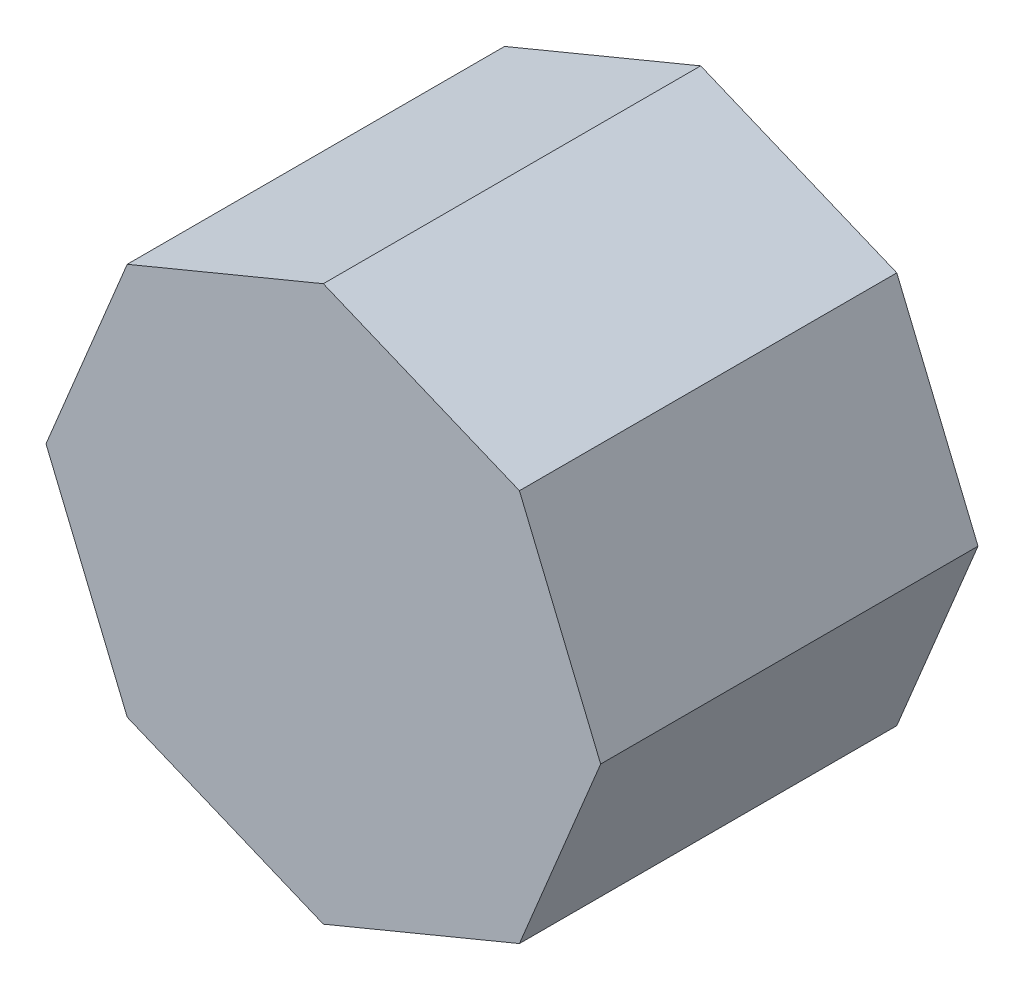
ISO-10303-21;
HEADER;
FILE_DESCRIPTION(('STEP AP214'),'2;1');
FILE_NAME('part.step','',(''),(''),'','','');
FILE_SCHEMA(('AUTOMOTIVE_DESIGN { 1 0 10303 214 1 1 1 1 }'));
ENDSEC;
DATA;
#1=APPLICATION_CONTEXT('core data for automotive mechanical design processes');
#2=APPLICATION_PROTOCOL_DEFINITION('international standard','automotive_design',2000,#1);
#3=PRODUCT_CONTEXT('',#1,'mechanical');
#4=PRODUCT('Part','Part','',(#3));
#5=PRODUCT_RELATED_PRODUCT_CATEGORY('part','',(#4));
#6=PRODUCT_DEFINITION_FORMATION('','',#4);
#7=PRODUCT_DEFINITION_CONTEXT('part definition',#1,'design');
#8=PRODUCT_DEFINITION('design','',#6,#7);
#9=PRODUCT_DEFINITION_SHAPE('','',#8);
#10=(LENGTH_UNIT() NAMED_UNIT(*) SI_UNIT(.MILLI.,.METRE.));
#11=(NAMED_UNIT(*) PLANE_ANGLE_UNIT() SI_UNIT($,.RADIAN.));
#12=(NAMED_UNIT(*) SI_UNIT($,.STERADIAN.) SOLID_ANGLE_UNIT());
#13=UNCERTAINTY_MEASURE_WITH_UNIT(LENGTH_MEASURE(1.E-05),#10,'distance_accuracy_value','');
#14=(GEOMETRIC_REPRESENTATION_CONTEXT(3) GLOBAL_UNCERTAINTY_ASSIGNED_CONTEXT((#13)) GLOBAL_UNIT_ASSIGNED_CONTEXT((#10,
#11,#12)) REPRESENTATION_CONTEXT('',''));
#15=CARTESIAN_POINT('',(0.,0.,0.));
#16=DIRECTION('',(0.,0.,1.));
#17=DIRECTION('',(1.,0.,0.));
#18=AXIS2_PLACEMENT_3D('',#15,#16,#17);
#19=CARTESIAN_POINT('',(-0.1530731,0.,0.20828));
#20=DIRECTION('',(0.,0.,-1.));
#21=DIRECTION('',(0.,-1.,0.));
#22=AXIS2_PLACEMENT_3D('',#19,#20,#21);
#23=PLANE('',#22);
#24=DIRECTION('',(0.382677940983037,-0.923881807097089,0.));
#25=VECTOR('',#24,1.);
#26=CARTESIAN_POINT('',(-0.1530731,0.,0.20828));
#27=LINE('',#26,#25);
#28=CARTESIAN_POINT('',(-0.1530731,0.,0.20828));
#29=VERTEX_POINT('',#28);
#30=CARTESIAN_POINT('',(-0.10823956,-0.10823956,0.20828));
#31=VERTEX_POINT('',#30);
#32=EDGE_CURVE('E164',#29,#31,#27,.T.);
#33=ORIENTED_EDGE('',*,*,#32,.T.);
#34=DIRECTION('',(0.923881807097089,-0.382677940983037,0.));
#35=VECTOR('',#34,1.);
#36=CARTESIAN_POINT('',(-0.10823956,-0.10823956,0.20828));
#37=LINE('',#36,#35);
#38=CARTESIAN_POINT('',(0.,-0.1530731,0.20828));
#39=VERTEX_POINT('',#38);
#40=EDGE_CURVE('E102',#31,#39,#37,.T.);
#41=ORIENTED_EDGE('',*,*,#40,.T.);
#42=DIRECTION('',(0.923881807097089,0.382677940983037,0.));
#43=VECTOR('',#42,1.);
#44=CARTESIAN_POINT('',(0.,-0.1530731,0.20828));
#45=LINE('',#44,#43);
#46=CARTESIAN_POINT('',(0.10823956,-0.10823956,0.20828));
#47=VERTEX_POINT('',#46);
#48=EDGE_CURVE('E100',#39,#47,#45,.T.);
#49=ORIENTED_EDGE('',*,*,#48,.T.);
#50=DIRECTION('',(0.382677940983037,0.923881807097089,0.));
#51=VECTOR('',#50,1.);
#52=CARTESIAN_POINT('',(0.10823956,-0.10823956,0.20828));
#53=LINE('',#52,#51);
#54=CARTESIAN_POINT('',(0.1530731,0.,0.20828));
#55=VERTEX_POINT('',#54);
#56=EDGE_CURVE('E84',#47,#55,#53,.T.);
#57=ORIENTED_EDGE('',*,*,#56,.T.);
#58=DIRECTION('',(-0.382677940983037,0.923881807097089,0.));
#59=VECTOR('',#58,1.);
#60=CARTESIAN_POINT('',(0.1530731,0.,0.20828));
#61=LINE('',#60,#59);
#62=CARTESIAN_POINT('',(0.10823956,0.10823956,0.20828));
#63=VERTEX_POINT('',#62);
#64=EDGE_CURVE('E146',#55,#63,#61,.T.);
#65=ORIENTED_EDGE('',*,*,#64,.T.);
#66=DIRECTION('',(-0.923881807097089,0.382677940983037,0.));
#67=VECTOR('',#66,1.);
#68=CARTESIAN_POINT('',(0.10823956,0.10823956,0.20828));
#69=LINE('',#68,#67);
#70=CARTESIAN_POINT('',(0.,0.1530731,0.20828));
#71=VERTEX_POINT('',#70);
#72=EDGE_CURVE('E141',#63,#71,#69,.T.);
#73=ORIENTED_EDGE('',*,*,#72,.T.);
#74=DIRECTION('',(-0.923881807097089,-0.382677940983037,0.));
#75=VECTOR('',#74,1.);
#76=CARTESIAN_POINT('',(0.,0.1530731,0.20828));
#77=LINE('',#76,#75);
#78=CARTESIAN_POINT('',(-0.10823956,0.10823956,0.20828));
#79=VERTEX_POINT('',#78);
#80=EDGE_CURVE('E123',#71,#79,#77,.T.);
#81=ORIENTED_EDGE('',*,*,#80,.T.);
#82=DIRECTION('',(-0.382677940983037,-0.923881807097089,0.));
#83=VECTOR('',#82,1.);
#84=CARTESIAN_POINT('',(-0.10823956,0.10823956,0.20828));
#85=LINE('',#84,#83);
#86=EDGE_CURVE('E11',#79,#29,#85,.T.);
#87=ORIENTED_EDGE('',*,*,#86,.T.);
#88=EDGE_LOOP('',(#33,#41,#49,#57,#65,#73,#81,#87));
#89=FACE_BOUND('',#88,.T.);
#90=ADVANCED_FACE('F17',(#89),#23,.F.);
#91=CARTESIAN_POINT('',(-0.1530731,0.,0.));
#92=DIRECTION('',(0.,0.,-1.));
#93=DIRECTION('',(0.,-1.,0.));
#94=AXIS2_PLACEMENT_3D('',#91,#92,#93);
#95=PLANE('',#94);
#96=DIRECTION('',(-0.382677940983037,-0.923881807097089,0.));
#97=VECTOR('',#96,1.);
#98=CARTESIAN_POINT('',(-0.10823956,0.10823956,0.));
#99=LINE('',#98,#97);
#100=CARTESIAN_POINT('',(-0.10823956,0.10823956,0.));
#101=VERTEX_POINT('',#100);
#102=CARTESIAN_POINT('',(-0.1530731,0.,0.));
#103=VERTEX_POINT('',#102);
#104=EDGE_CURVE('E28',#101,#103,#99,.T.);
#105=ORIENTED_EDGE('',*,*,#104,.F.);
#106=DIRECTION('',(-0.923881807097089,-0.382677940983037,0.));
#107=VECTOR('',#106,1.);
#108=CARTESIAN_POINT('',(0.,0.1530731,0.));
#109=LINE('',#108,#107);
#110=CARTESIAN_POINT('',(0.,0.1530731,0.));
#111=VERTEX_POINT('',#110);
#112=EDGE_CURVE('E117',#111,#101,#109,.T.);
#113=ORIENTED_EDGE('',*,*,#112,.F.);
#114=DIRECTION('',(-0.923881807097089,0.382677940983037,0.));
#115=VECTOR('',#114,1.);
#116=CARTESIAN_POINT('',(0.10823956,0.10823956,0.));
#117=LINE('',#116,#115);
#118=CARTESIAN_POINT('',(0.10823956,0.10823956,0.));
#119=VERTEX_POINT('',#118);
#120=EDGE_CURVE('E149',#119,#111,#117,.T.);
#121=ORIENTED_EDGE('',*,*,#120,.F.);
#122=DIRECTION('',(-0.382677940983037,0.923881807097089,0.));
#123=VECTOR('',#122,1.);
#124=CARTESIAN_POINT('',(0.1530731,0.,0.));
#125=LINE('',#124,#123);
#126=CARTESIAN_POINT('',(0.1530731,0.,0.));
#127=VERTEX_POINT('',#126);
#128=EDGE_CURVE('E96',#127,#119,#125,.T.);
#129=ORIENTED_EDGE('',*,*,#128,.F.);
#130=DIRECTION('',(0.382677940983037,0.923881807097089,0.));
#131=VECTOR('',#130,1.);
#132=CARTESIAN_POINT('',(0.10823956,-0.10823956,0.));
#133=LINE('',#132,#131);
#134=CARTESIAN_POINT('',(0.10823956,-0.10823956,0.));
#135=VERTEX_POINT('',#134);
#136=EDGE_CURVE('E107',#135,#127,#133,.T.);
#137=ORIENTED_EDGE('',*,*,#136,.F.);
#138=DIRECTION('',(0.923881807097089,0.382677940983037,0.));
#139=VECTOR('',#138,1.);
#140=CARTESIAN_POINT('',(0.,-0.1530731,0.));
#141=LINE('',#140,#139);
#142=CARTESIAN_POINT('',(0.,-0.1530731,0.));
#143=VERTEX_POINT('',#142);
#144=EDGE_CURVE('E21',#143,#135,#141,.T.);
#145=ORIENTED_EDGE('',*,*,#144,.F.);
#146=DIRECTION('',(0.923881807097089,-0.382677940983037,0.));
#147=VECTOR('',#146,1.);
#148=CARTESIAN_POINT('',(-0.10823956,-0.10823956,0.));
#149=LINE('',#148,#147);
#150=CARTESIAN_POINT('',(-0.10823956,-0.10823956,0.));
#151=VERTEX_POINT('',#150);
#152=EDGE_CURVE('E131',#151,#143,#149,.T.);
#153=ORIENTED_EDGE('',*,*,#152,.F.);
#154=DIRECTION('',(0.382677940983037,-0.923881807097089,0.));
#155=VECTOR('',#154,1.);
#156=CARTESIAN_POINT('',(-0.1530731,0.,0.));
#157=LINE('',#156,#155);
#158=EDGE_CURVE('E126',#103,#151,#157,.T.);
#159=ORIENTED_EDGE('',*,*,#158,.F.);
#160=EDGE_LOOP('',(#105,#113,#121,#129,#137,#145,#153,#159));
#161=FACE_BOUND('',#160,.T.);
#162=ADVANCED_FACE('F262',(#161),#95,.T.);
#163=CARTESIAN_POINT('',(-0.10823956,0.10823956,0.));
#164=DIRECTION('',(0.923881807097089,-0.382677940983037,0.));
#165=DIRECTION('',(0.,0.,-1.));
#166=AXIS2_PLACEMENT_3D('',#163,#164,#165);
#167=PLANE('',#166);
#168=ORIENTED_EDGE('',*,*,#104,.T.);
#169=DIRECTION('',(0.,0.,1.));
#170=VECTOR('',#169,1.);
#171=CARTESIAN_POINT('',(-0.1530731,0.,0.));
#172=LINE('',#171,#170);
#173=EDGE_CURVE('E136',#103,#29,#172,.T.);
#174=ORIENTED_EDGE('',*,*,#173,.T.);
#175=ORIENTED_EDGE('',*,*,#86,.F.);
#176=DIRECTION('',(0.,0.,1.));
#177=VECTOR('',#176,1.);
#178=CARTESIAN_POINT('',(-0.10823956,0.10823956,0.));
#179=LINE('',#178,#177);
#180=EDGE_CURVE('E119',#101,#79,#179,.T.);
#181=ORIENTED_EDGE('',*,*,#180,.F.);
#182=EDGE_LOOP('',(#168,#174,#175,#181));
#183=FACE_BOUND('',#182,.T.);
#184=ADVANCED_FACE('F179',(#183),#167,.F.);
#185=CARTESIAN_POINT('',(0.,0.1530731,0.));
#186=DIRECTION('',(0.382677940983037,-0.923881807097089,0.));
#187=DIRECTION('',(0.,0.,-1.));
#188=AXIS2_PLACEMENT_3D('',#185,#186,#187);
#189=PLANE('',#188);
#190=ORIENTED_EDGE('',*,*,#112,.T.);
#191=ORIENTED_EDGE('',*,*,#180,.T.);
#192=ORIENTED_EDGE('',*,*,#80,.F.);
#193=DIRECTION('',(0.,0.,1.));
#194=VECTOR('',#193,1.);
#195=CARTESIAN_POINT('',(0.,0.1530731,0.));
#196=LINE('',#195,#194);
#197=EDGE_CURVE('E145',#111,#71,#196,.T.);
#198=ORIENTED_EDGE('',*,*,#197,.F.);
#199=EDGE_LOOP('',(#190,#191,#192,#198));
#200=FACE_BOUND('',#199,.T.);
#201=ADVANCED_FACE('F189',(#200),#189,.F.);
#202=CARTESIAN_POINT('',(0.10823956,0.10823956,0.));
#203=DIRECTION('',(-0.382677940983037,-0.923881807097089,0.));
#204=DIRECTION('',(-0.923881807097089,0.382677940983037,0.));
#205=AXIS2_PLACEMENT_3D('',#202,#203,#204);
#206=PLANE('',#205);
#207=ORIENTED_EDGE('',*,*,#120,.T.);
#208=ORIENTED_EDGE('',*,*,#197,.T.);
#209=ORIENTED_EDGE('',*,*,#72,.F.);
#210=DIRECTION('',(0.,0.,1.));
#211=VECTOR('',#210,1.);
#212=CARTESIAN_POINT('',(0.10823956,0.10823956,0.));
#213=LINE('',#212,#211);
#214=EDGE_CURVE('E150',#119,#63,#213,.T.);
#215=ORIENTED_EDGE('',*,*,#214,.F.);
#216=EDGE_LOOP('',(#207,#208,#209,#215));
#217=FACE_BOUND('',#216,.T.);
#218=ADVANCED_FACE('F246',(#217),#206,.F.);
#219=CARTESIAN_POINT('',(0.1530731,0.,0.));
#220=DIRECTION('',(-0.923881807097089,-0.382677940983037,0.));
#221=DIRECTION('',(-0.382677940983037,0.923881807097089,0.));
#222=AXIS2_PLACEMENT_3D('',#219,#220,#221);
#223=PLANE('',#222);
#224=ORIENTED_EDGE('',*,*,#128,.T.);
#225=ORIENTED_EDGE('',*,*,#214,.T.);
#226=ORIENTED_EDGE('',*,*,#64,.F.);
#227=DIRECTION('',(0.,0.,1.));
#228=VECTOR('',#227,1.);
#229=CARTESIAN_POINT('',(0.1530731,0.,0.));
#230=LINE('',#229,#228);
#231=EDGE_CURVE('E92',#127,#55,#230,.T.);
#232=ORIENTED_EDGE('',*,*,#231,.F.);
#233=EDGE_LOOP('',(#224,#225,#226,#232));
#234=FACE_BOUND('',#233,.T.);
#235=ADVANCED_FACE('F251',(#234),#223,.F.);
#236=CARTESIAN_POINT('',(0.10823956,-0.10823956,0.));
#237=DIRECTION('',(-0.923881807097089,0.382677940983037,0.));
#238=DIRECTION('',(0.,0.,1.));
#239=AXIS2_PLACEMENT_3D('',#236,#237,#238);
#240=PLANE('',#239);
#241=ORIENTED_EDGE('',*,*,#136,.T.);
#242=ORIENTED_EDGE('',*,*,#231,.T.);
#243=ORIENTED_EDGE('',*,*,#56,.F.);
#244=DIRECTION('',(0.,0.,1.));
#245=VECTOR('',#244,1.);
#246=CARTESIAN_POINT('',(0.10823956,-0.10823956,0.));
#247=LINE('',#246,#245);
#248=EDGE_CURVE('E89',#135,#47,#247,.T.);
#249=ORIENTED_EDGE('',*,*,#248,.F.);
#250=EDGE_LOOP('',(#241,#242,#243,#249));
#251=FACE_BOUND('',#250,.T.);
#252=ADVANCED_FACE('F87',(#251),#240,.F.);
#253=CARTESIAN_POINT('',(0.,-0.1530731,0.));
#254=DIRECTION('',(-0.382677940983037,0.923881807097089,0.));
#255=DIRECTION('',(0.,0.,1.));
#256=AXIS2_PLACEMENT_3D('',#253,#254,#255);
#257=PLANE('',#256);
#258=ORIENTED_EDGE('',*,*,#144,.T.);
#259=ORIENTED_EDGE('',*,*,#248,.T.);
#260=ORIENTED_EDGE('',*,*,#48,.F.);
#261=DIRECTION('',(0.,0.,1.));
#262=VECTOR('',#261,1.);
#263=CARTESIAN_POINT('',(0.,-0.1530731,0.));
#264=LINE('',#263,#262);
#265=EDGE_CURVE('E135',#143,#39,#264,.T.);
#266=ORIENTED_EDGE('',*,*,#265,.F.);
#267=EDGE_LOOP('',(#258,#259,#260,#266));
#268=FACE_BOUND('',#267,.T.);
#269=ADVANCED_FACE('F19',(#268),#257,.F.);
#270=CARTESIAN_POINT('',(-0.10823956,-0.10823956,0.));
#271=DIRECTION('',(0.382677940983037,0.923881807097089,0.));
#272=DIRECTION('',(0.,0.,-1.));
#273=AXIS2_PLACEMENT_3D('',#270,#271,#272);
#274=PLANE('',#273);
#275=ORIENTED_EDGE('',*,*,#152,.T.);
#276=ORIENTED_EDGE('',*,*,#265,.T.);
#277=ORIENTED_EDGE('',*,*,#40,.F.);
#278=DIRECTION('',(0.,0.,1.));
#279=VECTOR('',#278,1.);
#280=CARTESIAN_POINT('',(-0.10823956,-0.10823956,0.));
#281=LINE('',#280,#279);
#282=EDGE_CURVE('E130',#151,#31,#281,.T.);
#283=ORIENTED_EDGE('',*,*,#282,.F.);
#284=EDGE_LOOP('',(#275,#276,#277,#283));
#285=FACE_BOUND('',#284,.T.);
#286=ADVANCED_FACE('F288',(#285),#274,.F.);
#287=CARTESIAN_POINT('',(-0.1530731,0.,0.));
#288=DIRECTION('',(0.923881807097089,0.382677940983037,0.));
#289=DIRECTION('',(0.,0.,-1.));
#290=AXIS2_PLACEMENT_3D('',#287,#288,#289);
#291=PLANE('',#290);
#292=ORIENTED_EDGE('',*,*,#158,.T.);
#293=ORIENTED_EDGE('',*,*,#282,.T.);
#294=ORIENTED_EDGE('',*,*,#32,.F.);
#295=ORIENTED_EDGE('',*,*,#173,.F.);
#296=EDGE_LOOP('',(#292,#293,#294,#295));
#297=FACE_BOUND('',#296,.T.);
#298=ADVANCED_FACE('F182',(#297),#291,.F.);
#299=CLOSED_SHELL('',(#90,#162,#184,#201,#218,#235,#252,#269,#286,#298));
#300=MANIFOLD_SOLID_BREP('B1',#299);
#301=ADVANCED_BREP_SHAPE_REPRESENTATION('',(#18,#300),#14);
#302=SHAPE_DEFINITION_REPRESENTATION(#9,#301);
ENDSEC;
END-ISO-10303-21;
